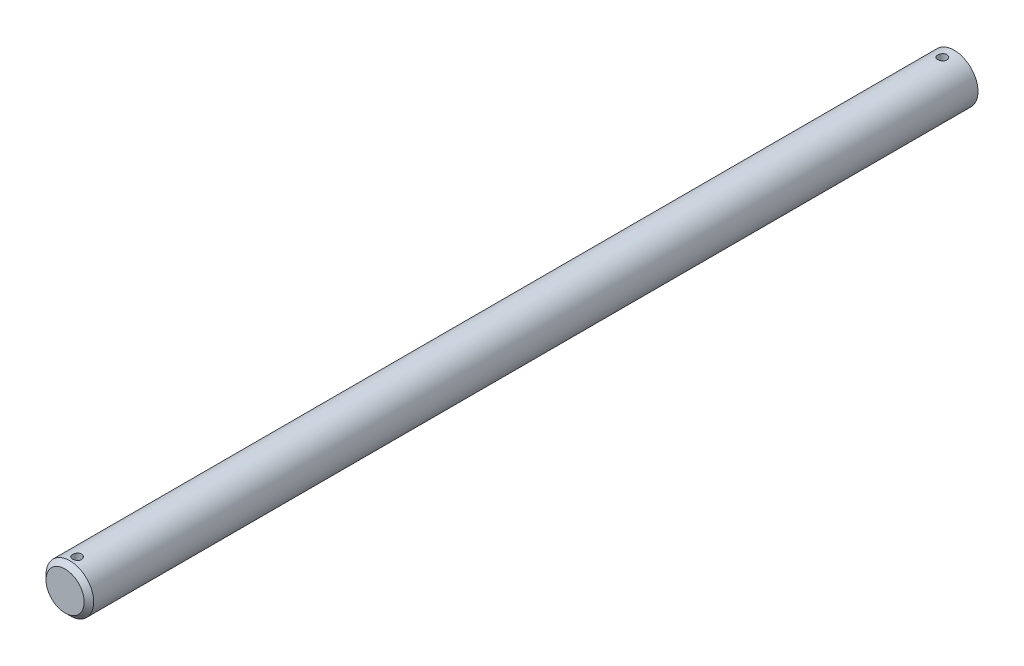
ISO-10303-21;
HEADER;
FILE_DESCRIPTION(('STEP AP214'),'2;1');
FILE_NAME('part.step','',(''),(''),'','','');
FILE_SCHEMA(('AUTOMOTIVE_DESIGN { 1 0 10303 214 1 1 1 1 }'));
ENDSEC;
DATA;
#1=APPLICATION_CONTEXT('core data for automotive mechanical design processes');
#2=APPLICATION_PROTOCOL_DEFINITION('international standard','automotive_design',2000,#1);
#3=PRODUCT_CONTEXT('',#1,'mechanical');
#4=PRODUCT('Part','Part','',(#3));
#5=PRODUCT_RELATED_PRODUCT_CATEGORY('part','',(#4));
#6=PRODUCT_DEFINITION_FORMATION('','',#4);
#7=PRODUCT_DEFINITION_CONTEXT('part definition',#1,'design');
#8=PRODUCT_DEFINITION('design','',#6,#7);
#9=PRODUCT_DEFINITION_SHAPE('','',#8);
#10=(LENGTH_UNIT() NAMED_UNIT(*) SI_UNIT(.MILLI.,.METRE.));
#11=(NAMED_UNIT(*) PLANE_ANGLE_UNIT() SI_UNIT($,.RADIAN.));
#12=(NAMED_UNIT(*) SI_UNIT($,.STERADIAN.) SOLID_ANGLE_UNIT());
#13=UNCERTAINTY_MEASURE_WITH_UNIT(LENGTH_MEASURE(1.E-05),#10,'distance_accuracy_value','');
#14=(GEOMETRIC_REPRESENTATION_CONTEXT(3) GLOBAL_UNCERTAINTY_ASSIGNED_CONTEXT((#13)) GLOBAL_UNIT_ASSIGNED_CONTEXT((#10,
#11,#12)) REPRESENTATION_CONTEXT('',''));
#15=CARTESIAN_POINT('',(0.,0.,0.));
#16=DIRECTION('',(0.,0.,1.));
#17=DIRECTION('',(1.,0.,0.));
#18=AXIS2_PLACEMENT_3D('',#15,#16,#17);
#19=CARTESIAN_POINT('',(0.,0.,304.8));
#20=DIRECTION('',(0.,0.,-1.));
#21=DIRECTION('',(-1.,0.,0.));
#22=AXIS2_PLACEMENT_3D('',#19,#20,#21);
#23=CYLINDRICAL_SURFACE('',#22,3.175);
#24=CARTESIAN_POINT('',(0.,-3.17500000000001,188.655762388));
#25=CARTESIAN_POINT('',(0.033127849378484,-3.17499940005936,188.655761122132));
#26=CARTESIAN_POINT('',(0.0662721689897592,-3.17447616437681,188.652987804467));
#27=CARTESIAN_POINT('',(0.131626820280966,-3.17243930650301,188.641974952437));
#28=CARTESIAN_POINT('',(0.163836339741667,-3.17092484847488,188.633730804777));
#29=CARTESIAN_POINT('',(0.226366769234935,-3.16707495697542,188.612037597188));
#30=CARTESIAN_POINT('',(0.256689356240747,-3.16474026510011,188.598593237808));
#31=CARTESIAN_POINT('',(0.314645664321686,-3.1595048514429,188.566894583721));
#32=CARTESIAN_POINT('',(0.34227960280819,-3.1566041754851,188.548640678371));
#33=CARTESIAN_POINT('',(0.394407912259925,-3.15051811645857,188.507609042574));
#34=CARTESIAN_POINT('',(0.418865429028267,-3.14733001333615,188.484784889647));
#35=CARTESIAN_POINT('',(0.463627811849755,-3.14104860763278,188.435360512206));
#36=CARTESIAN_POINT('',(0.483932379579185,-3.13795531187579,188.408760016654));
#37=CARTESIAN_POINT('',(0.519965775954876,-3.13218731275362,188.352277596681));
#38=CARTESIAN_POINT('',(0.535657115316884,-3.12951611636079,188.32237136603));
#39=CARTESIAN_POINT('',(0.561778643443758,-3.12493308056008,188.260288787289));
#40=CARTESIAN_POINT('',(0.572209285923865,-3.1230211756692,188.228112635243));
#41=CARTESIAN_POINT('',(0.587395056092022,-3.120200569874,188.162797905731));
#42=CARTESIAN_POINT('',(0.592214454824663,-3.11928051754792,188.129674771297));
#43=CARTESIAN_POINT('',(0.596240425878416,-3.11851356370003,188.063078238404));
#44=CARTESIAN_POINT('',(0.595447501537276,-3.11866656594196,188.029604871624));
#45=CARTESIAN_POINT('',(0.588323450296885,-3.12001809916009,187.96372370141));
#46=CARTESIAN_POINT('',(0.582065407796813,-3.12120283233474,187.931307670137));
#47=CARTESIAN_POINT('',(0.56430386010371,-3.12446266491103,187.867993921399));
#48=CARTESIAN_POINT('',(0.552800132013027,-3.12653780214715,187.837096268514));
#49=CARTESIAN_POINT('',(0.524802287242859,-3.13135905069247,187.777482506022));
#50=CARTESIAN_POINT('',(0.508278659956946,-3.13410911079899,187.748780588738));
#51=CARTESIAN_POINT('',(0.470730932942595,-3.13996773104909,187.694529261361));
#52=CARTESIAN_POINT('',(0.449706376466776,-3.14307632756161,187.668980171626));
#53=CARTESIAN_POINT('',(0.403359563188529,-3.14936188004891,187.621337483717));
#54=CARTESIAN_POINT('',(0.377974795254094,-3.15253914125163,187.599304691558));
#55=CARTESIAN_POINT('',(0.323837314723615,-3.15855900111739,187.559801108107));
#56=CARTESIAN_POINT('',(0.295084568364026,-3.16140159642489,187.542330362555));
#57=CARTESIAN_POINT('',(0.234963886209648,-3.16643757934512,187.512437841933));
#58=CARTESIAN_POINT('',(0.203592733389714,-3.16863015282215,187.500022391288));
#59=CARTESIAN_POINT('',(0.139159898923864,-3.17211275581705,187.480654369804));
#60=CARTESIAN_POINT('',(0.10609839726025,-3.17340288121049,187.473701218644));
#61=CARTESIAN_POINT('',(0.0397464966210308,-3.17492205629787,187.46553980694));
#62=CARTESIAN_POINT('',(0.00646668626417217,-3.17516649268311,187.464248232612));
#63=CARTESIAN_POINT('',(-0.0598333703365867,-3.17460925115548,187.467223156445));
#64=CARTESIAN_POINT('',(-0.0928536292531548,-3.1738076246401,187.471489381529));
#65=CARTESIAN_POINT('',(-0.157432999370983,-3.17125791126725,187.485389536338));
#66=CARTESIAN_POINT('',(-0.189001503602661,-3.16951726067194,187.494981309507));
#67=CARTESIAN_POINT('',(-0.250082300755404,-3.16528387378086,187.519214665378));
#68=CARTESIAN_POINT('',(-0.279594453904932,-3.16279108642312,187.53385659094));
#69=CARTESIAN_POINT('',(-0.336080366506809,-3.157291557982,187.567959020113));
#70=CARTESIAN_POINT('',(-0.363022863065382,-3.1542794982553,187.587470431107));
#71=CARTESIAN_POINT('',(-0.413281147045624,-3.1480892694748,187.630689086266));
#72=CARTESIAN_POINT('',(-0.43659659543635,-3.14491108492986,187.654396722222));
#73=CARTESIAN_POINT('',(-0.479255517992203,-3.13869576292426,187.705712027068));
#74=CARTESIAN_POINT('',(-0.498542136242496,-3.1356610588829,187.733367304662));
#75=CARTESIAN_POINT('',(-0.532196179135613,-3.1301252865148,187.791574070233));
#76=CARTESIAN_POINT('',(-0.546563786592779,-3.12762419835761,187.822125450522));
#77=CARTESIAN_POINT('',(-0.569891360504028,-3.12345793983175,187.885112841562));
#78=CARTESIAN_POINT('',(-0.578877385529318,-3.12178874798387,187.917538923013));
#79=CARTESIAN_POINT('',(-0.591267071076007,-3.11946609009084,187.983474879438));
#80=CARTESIAN_POINT('',(-0.594671361418134,-3.11881250944861,188.016984631701));
#81=CARTESIAN_POINT('',(-0.595779868526295,-3.11860088672156,188.083567194541));
#82=CARTESIAN_POINT('',(-0.593573770795147,-3.11902560714798,188.116638490442));
#83=CARTESIAN_POINT('',(-0.583720477284632,-3.12088450886938,188.181929921124));
#84=CARTESIAN_POINT('',(-0.576073314010797,-3.12231868413375,188.214150060988));
#85=CARTESIAN_POINT('',(-0.555592803846087,-3.126027641217,188.276776324153));
#86=CARTESIAN_POINT('',(-0.542769168607853,-3.12830084823627,188.30718572269));
#87=CARTESIAN_POINT('',(-0.512309542245322,-3.13343285059637,188.365435726402));
#88=CARTESIAN_POINT('',(-0.49467321113813,-3.13629168730423,188.39327614991));
#89=CARTESIAN_POINT('',(-0.4547770278788,-3.14232633736512,188.446047161017));
#90=CARTESIAN_POINT('',(-0.432451906336468,-3.1455062556199,188.470927942363));
#91=CARTESIAN_POINT('',(-0.383947958425856,-3.15179405961499,188.516620061853));
#92=CARTESIAN_POINT('',(-0.357768247938247,-3.15490192863972,188.537430463827));
#93=CARTESIAN_POINT('',(-0.302015900075408,-3.1607282796232,188.574566109824));
#94=CARTESIAN_POINT('',(-0.27241483753546,-3.1634430039313,188.590849286182));
#95=CARTESIAN_POINT('',(-0.210855763856364,-3.16814048941711,188.618185325028));
#96=CARTESIAN_POINT('',(-0.178899999270517,-3.17012393770744,188.629243100109));
#97=CARTESIAN_POINT('',(-0.122375296121229,-3.17273102874592,188.64356932216));
#98=CARTESIAN_POINT('',(-0.0981367934437089,-3.17357708754789,188.648133906905));
#99=CARTESIAN_POINT('',(-0.049268557448828,-3.17471178919249,188.654230872027));
#100=CARTESIAN_POINT('',(-0.0246388340934195,-3.1750004462058,188.655763329489));
#101=CARTESIAN_POINT('',(0.,-3.17500000000001,188.655762388));
#102=B_SPLINE_CURVE_WITH_KNOTS('',3,(#24,#25,#26,#27,#28,#29,#30,#31,#32,#33,#34,#35,#36,#37,
#38,#39,#40,#41,#42,#43,#44,#45,#46,#47,#48,#49,#50,#51,#52,#53,#54,#55,#56,#57,#58,#59,#60,#61,
#62,#63,#64,#65,#66,#67,#68,#69,#70,#71,#72,#73,#74,#75,#76,#77,#78,#79,#80,#81,#82,#83,#84,#85,
#86,#87,#88,#89,#90,#91,#92,#93,#94,#95,#96,#97,#98,#99,#100,#101),.UNSPECIFIED.,.T.,.F.,(4,2,2,
2,2,2,2,2,2,2,2,2,2,2,2,2,2,2,2,2,2,2,2,2,2,2,2,2,2,2,2,2,2,2,2,2,2,2,4),(0.,0.099293442257959,
0.198670720631257,0.297958379519774,0.397238003055785,0.497582499616608,0.597934201813108,
0.699080193564202,0.800217460363051,0.900184538548682,1.00014265136194,1.0987841586819,
1.19742985782943,1.29666707356097,1.39591436451039,1.4967258310918,1.59753830838151,
1.69847652240176,1.79940401117395,1.89884119086453,1.99827348496884,2.09692967832172,
2.19559257087285,2.2953336190078,2.39508398463951,2.4961589530434,2.59723016460249,
2.69780792915495,2.79837434413152,2.89734328229483,2.99631162921165,3.09509515682432,
3.19388566460124,3.29415524955411,3.39444786907213,3.49564344413668,3.59674369125816,
3.67059505483131,3.74444454087573),.UNSPECIFIED.);
#103=CARTESIAN_POINT('',(0.,-3.17500000000001,188.655762388));
#104=VERTEX_POINT('',#103);
#105=EDGE_CURVE('E10',#104,#104,#102,.T.);
#106=ORIENTED_EDGE('',*,*,#105,.T.);
#107=EDGE_LOOP('',(#106));
#108=FACE_BOUND('',#107,.T.);
#109=CARTESIAN_POINT('',(0.,3.17499999999999,188.655762388));
#110=CARTESIAN_POINT('',(-0.0331278493784867,3.17499940005934,188.655761122132));
#111=CARTESIAN_POINT('',(-0.0662721689897619,3.1744761643768,188.652987804467));
#112=CARTESIAN_POINT('',(-0.131626820280968,3.17243930650299,188.641974952437));
#113=CARTESIAN_POINT('',(-0.163836339741669,3.17092484847486,188.633730804777));
#114=CARTESIAN_POINT('',(-0.226366769234938,3.1670749569754,188.612037597188));
#115=CARTESIAN_POINT('',(-0.25668935624075,3.16474026510009,188.598593237808));
#116=CARTESIAN_POINT('',(-0.314645664321688,3.15950485144288,188.566894583721));
#117=CARTESIAN_POINT('',(-0.342279602808193,3.15660417548508,188.548640678371));
#118=CARTESIAN_POINT('',(-0.394407912259927,3.15051811645855,188.507609042574));
#119=CARTESIAN_POINT('',(-0.41886542902827,3.14733001333613,188.484784889647));
#120=CARTESIAN_POINT('',(-0.463627811849758,3.14104860763276,188.435360512206));
#121=CARTESIAN_POINT('',(-0.483932379579187,3.13795531187577,188.408760016654));
#122=CARTESIAN_POINT('',(-0.519965775954879,3.1321873127536,188.352277596681));
#123=CARTESIAN_POINT('',(-0.535657115316887,3.12951611636077,188.32237136603));
#124=CARTESIAN_POINT('',(-0.561778643443761,3.12493308056006,188.260288787289));
#125=CARTESIAN_POINT('',(-0.572209285923868,3.12302117566918,188.228112635243));
#126=CARTESIAN_POINT('',(-0.58739505609203,3.12020056987398,188.162797905731));
#127=CARTESIAN_POINT('',(-0.592214454824671,3.11928051754791,188.129674771297));
#128=CARTESIAN_POINT('',(-0.596240425878418,3.11851356370001,188.063078238404));
#129=CARTESIAN_POINT('',(-0.595447501537276,3.11866656594194,188.029604871624));
#130=CARTESIAN_POINT('',(-0.588323450296887,3.12001809916007,187.96372370141));
#131=CARTESIAN_POINT('',(-0.582065407796816,3.12120283233472,187.931307670137));
#132=CARTESIAN_POINT('',(-0.564303860103713,3.12446266491101,187.867993921399));
#133=CARTESIAN_POINT('',(-0.552800132013029,3.12653780214713,187.837096268514));
#134=CARTESIAN_POINT('',(-0.524802287242862,3.13135905069245,187.777482506022));
#135=CARTESIAN_POINT('',(-0.508278659956949,3.13410911079897,187.748780588738));
#136=CARTESIAN_POINT('',(-0.470730932942598,3.13996773104907,187.694529261361));
#137=CARTESIAN_POINT('',(-0.449706376466779,3.14307632756159,187.668980171626));
#138=CARTESIAN_POINT('',(-0.403359563188532,3.14936188004889,187.621337483717));
#139=CARTESIAN_POINT('',(-0.377974795254097,3.15253914125161,187.599304691558));
#140=CARTESIAN_POINT('',(-0.323837314723618,3.15855900111738,187.559801108107));
#141=CARTESIAN_POINT('',(-0.295084568364029,3.16140159642487,187.542330362555));
#142=CARTESIAN_POINT('',(-0.234963886209651,3.1664375793451,187.512437841933));
#143=CARTESIAN_POINT('',(-0.203592733389717,3.16863015282214,187.500022391288));
#144=CARTESIAN_POINT('',(-0.139159898923867,3.17211275581703,187.480654369804));
#145=CARTESIAN_POINT('',(-0.106098397260253,3.17340288121047,187.473701218644));
#146=CARTESIAN_POINT('',(-0.0397464966210335,3.17492205629785,187.46553980694));
#147=CARTESIAN_POINT('',(-0.00646668626417488,3.1751664926831,187.464248232612));
#148=CARTESIAN_POINT('',(0.059833370336584,3.17460925115546,187.467223156445));
#149=CARTESIAN_POINT('',(0.0928536292531521,3.17380762464008,187.471489381529));
#150=CARTESIAN_POINT('',(0.157432999370981,3.17125791126723,187.485389536338));
#151=CARTESIAN_POINT('',(0.189001503602658,3.16951726067192,187.494981309507));
#152=CARTESIAN_POINT('',(0.250082300755401,3.16528387378084,187.519214665378));
#153=CARTESIAN_POINT('',(0.27959445390493,3.1627910864231,187.53385659094));
#154=CARTESIAN_POINT('',(0.336080366506806,3.15729155798198,187.567959020113));
#155=CARTESIAN_POINT('',(0.36302286306538,3.15427949825529,187.587470431107));
#156=CARTESIAN_POINT('',(0.413281147045622,3.14808926947478,187.630689086266));
#157=CARTESIAN_POINT('',(0.436596595436347,3.14491108492984,187.654396722222));
#158=CARTESIAN_POINT('',(0.4792555179922,3.13869576292424,187.705712027068));
#159=CARTESIAN_POINT('',(0.498542136242493,3.13566105888288,187.733367304662));
#160=CARTESIAN_POINT('',(0.53219617913561,3.13012528651479,187.791574070233));
#161=CARTESIAN_POINT('',(0.546563786592776,3.12762419835759,187.822125450522));
#162=CARTESIAN_POINT('',(0.569891360504025,3.12345793983173,187.885112841562));
#163=CARTESIAN_POINT('',(0.578877385529315,3.12178874798385,187.917538923013));
#164=CARTESIAN_POINT('',(0.591267071076004,3.11946609009082,187.983474879438));
#165=CARTESIAN_POINT('',(0.594671361418131,3.11881250944859,188.016984631701));
#166=CARTESIAN_POINT('',(0.595779868526292,3.11860088672155,188.083567194541));
#167=CARTESIAN_POINT('',(0.593573770795144,3.11902560714797,188.116638490442));
#168=CARTESIAN_POINT('',(0.583720477284629,3.12088450886936,188.181929921124));
#169=CARTESIAN_POINT('',(0.576073314010794,3.12231868413373,188.214150060988));
#170=CARTESIAN_POINT('',(0.555592803846084,3.12602764121698,188.276776324153));
#171=CARTESIAN_POINT('',(0.542769168607851,3.12830084823626,188.30718572269));
#172=CARTESIAN_POINT('',(0.512309542245319,3.13343285059635,188.365435726402));
#173=CARTESIAN_POINT('',(0.494673211138128,3.13629168730421,188.39327614991));
#174=CARTESIAN_POINT('',(0.454777027878797,3.1423263373651,188.446047161017));
#175=CARTESIAN_POINT('',(0.432451906336466,3.14550625561988,188.470927942363));
#176=CARTESIAN_POINT('',(0.383947958425854,3.15179405961497,188.516620061853));
#177=CARTESIAN_POINT('',(0.357768247938244,3.1549019286397,188.537430463827));
#178=CARTESIAN_POINT('',(0.302015900075406,3.16072827962318,188.574566109824));
#179=CARTESIAN_POINT('',(0.272414837535457,3.16344300393128,188.590849286182));
#180=CARTESIAN_POINT('',(0.210855763856361,3.16814048941709,188.618185325028));
#181=CARTESIAN_POINT('',(0.178899999270514,3.17012393770742,188.629243100109));
#182=CARTESIAN_POINT('',(0.122375296121227,3.17273102874591,188.64356932216));
#183=CARTESIAN_POINT('',(0.0981367934437061,3.17357708754787,188.648133906905));
#184=CARTESIAN_POINT('',(0.0492685574488253,3.17471178919247,188.654230872027));
#185=CARTESIAN_POINT('',(0.0246388340934168,3.17500044620578,188.655763329489));
#186=CARTESIAN_POINT('',(0.,3.17499999999999,188.655762388));
#187=B_SPLINE_CURVE_WITH_KNOTS('',3,(#109,#110,#111,#112,#113,#114,#115,#116,#117,#118,#119,
#120,#121,#122,#123,#124,#125,#126,#127,#128,#129,#130,#131,#132,#133,#134,#135,#136,#137,#138,
#139,#140,#141,#142,#143,#144,#145,#146,#147,#148,#149,#150,#151,#152,#153,#154,#155,#156,#157,
#158,#159,#160,#161,#162,#163,#164,#165,#166,#167,#168,#169,#170,#171,#172,#173,#174,#175,#176,
#177,#178,#179,#180,#181,#182,#183,#184,#185,#186),.UNSPECIFIED.,.T.,.F.,(4,2,2,2,2,2,2,2,2,2,2,
2,2,2,2,2,2,2,2,2,2,2,2,2,2,2,2,2,2,2,2,2,2,2,2,2,2,2,4),(0.,0.099293442257959,
0.198670720631257,0.297958379519774,0.397238003055785,0.497582499616609,0.597934201813108,
0.699080193564202,0.800217460363051,0.900184538548737,1.00014265136194,1.0987841586819,
1.19742985782943,1.29666707356097,1.39591436451039,1.4967258310918,1.59753830838151,
1.69847652240176,1.79940401117395,1.89884119086453,1.99827348496884,2.09692967832172,
2.19559257087285,2.29533361900781,2.39508398463951,2.4961589530434,2.59723016460249,
2.69780792915495,2.79837434413152,2.89734328229483,2.99631162921165,3.09509515682432,
3.19388566460124,3.29415524955411,3.39444786907213,3.49564344413668,3.59674369125816,
3.67059505483131,3.74444454087573),.UNSPECIFIED.);
#188=CARTESIAN_POINT('',(0.,3.17499999999999,188.655762388));
#189=VERTEX_POINT('',#188);
#190=EDGE_CURVE('E45',#189,#189,#187,.T.);
#191=ORIENTED_EDGE('',*,*,#190,.T.);
#192=EDGE_LOOP('',(#191));
#193=FACE_BOUND('',#192,.T.);
#194=CARTESIAN_POINT('',(0.,-3.17500000000001,303.8078125));
#195=CARTESIAN_POINT('',(0.0331278493784956,-3.17499940005936,303.807811234132));
#196=CARTESIAN_POINT('',(0.0662721689897699,-3.17447616437681,303.805037916467));
#197=CARTESIAN_POINT('',(0.131626820280976,-3.17243930650301,303.794025064437));
#198=CARTESIAN_POINT('',(0.163836339741677,-3.17092484847488,303.785780916777));
#199=CARTESIAN_POINT('',(0.226366769234958,-3.16707495697542,303.764087709188));
#200=CARTESIAN_POINT('',(0.256689356240781,-3.16474026510011,303.750643349808));
#201=CARTESIAN_POINT('',(0.314645664321714,-3.15950485144289,303.718944695721));
#202=CARTESIAN_POINT('',(0.342279602808203,-3.15660417548509,303.700690790371));
#203=CARTESIAN_POINT('',(0.394407912259931,-3.15051811645857,303.659659154574));
#204=CARTESIAN_POINT('',(0.41886542902828,-3.14733001333615,303.636835001646));
#205=CARTESIAN_POINT('',(0.463627811849776,-3.14104860763277,303.587410624206));
#206=CARTESIAN_POINT('',(0.483932379579207,-3.13795531187578,303.560810128654));
#207=CARTESIAN_POINT('',(0.519965775954901,-3.13218731275362,303.504327708681));
#208=CARTESIAN_POINT('',(0.535657115316909,-3.12951611636079,303.47442147803));
#209=CARTESIAN_POINT('',(0.561778643443776,-3.12493308056008,303.412338899289));
#210=CARTESIAN_POINT('',(0.572209285923881,-3.1230211756692,303.380162747243));
#211=CARTESIAN_POINT('',(0.587395056092034,-3.120200569874,303.314848017731));
#212=CARTESIAN_POINT('',(0.592214454824669,-3.11928051754792,303.281724883297));
#213=CARTESIAN_POINT('',(0.596240425878417,-3.11851356370003,303.215128350404));
#214=CARTESIAN_POINT('',(0.595447501537278,-3.11866656594196,303.181654983624));
#215=CARTESIAN_POINT('',(0.58832345029689,-3.12001809916009,303.11577381341));
#216=CARTESIAN_POINT('',(0.582065407796815,-3.12120283233474,303.083357782137));
#217=CARTESIAN_POINT('',(0.564303860103707,-3.12446266491103,303.020044033399));
#218=CARTESIAN_POINT('',(0.552800132013023,-3.12653780214715,302.989146380513));
#219=CARTESIAN_POINT('',(0.524802287242861,-3.13135905069247,302.929532618022));
#220=CARTESIAN_POINT('',(0.508278659956958,-3.13410911079899,302.900830700738));
#221=CARTESIAN_POINT('',(0.470730932942623,-3.13996773104909,302.846579373361));
#222=CARTESIAN_POINT('',(0.449706376466809,-3.14307632756161,302.821030283626));
#223=CARTESIAN_POINT('',(0.403359563188558,-3.14936188004891,302.773387595718));
#224=CARTESIAN_POINT('',(0.377974795254109,-3.15253914125163,302.751354803558));
#225=CARTESIAN_POINT('',(0.323837314723599,-3.1585590011174,302.711851220107));
#226=CARTESIAN_POINT('',(0.295084568363997,-3.16140159642489,302.694380474555));
#227=CARTESIAN_POINT('',(0.234963886209613,-3.16643757934512,302.664487953933));
#228=CARTESIAN_POINT('',(0.203592733389688,-3.16863015282216,302.652072503288));
#229=CARTESIAN_POINT('',(0.139159898923856,-3.17211275581705,302.632704481804));
#230=CARTESIAN_POINT('',(0.106098397260251,-3.17340288121049,302.625751330645));
#231=CARTESIAN_POINT('',(0.0397464966210445,-3.17492205629787,302.61758991894));
#232=CARTESIAN_POINT('',(0.00646668626418795,-3.17516649268312,302.616298344612));
#233=CARTESIAN_POINT('',(-0.0598333703365708,-3.17460925115548,302.619273268446));
#234=CARTESIAN_POINT('',(-0.0928536292531409,-3.1738076246401,302.623539493529));
#235=CARTESIAN_POINT('',(-0.157432999370963,-3.17125791126725,302.637439648338));
#236=CARTESIAN_POINT('',(-0.189001503602631,-3.16951726067195,302.647031421507));
#237=CARTESIAN_POINT('',(-0.250082300755378,-3.16528387378086,302.671264777378));
#238=CARTESIAN_POINT('',(-0.279594453904919,-3.16279108642312,302.68590670294));
#239=CARTESIAN_POINT('',(-0.33608036650679,-3.157291557982,302.720009132113));
#240=CARTESIAN_POINT('',(-0.363022863065345,-3.15427949825531,302.739520543107));
#241=CARTESIAN_POINT('',(-0.413281147045584,-3.14808926947481,302.782739198266));
#242=CARTESIAN_POINT('',(-0.436596595436325,-3.14491108492986,302.806446834222));
#243=CARTESIAN_POINT('',(-0.479255517992183,-3.13869576292427,302.857762139068));
#244=CARTESIAN_POINT('',(-0.498542136242465,-3.13566105888291,302.885417416662));
#245=CARTESIAN_POINT('',(-0.532196179135576,-3.13012528651481,302.943624182233));
#246=CARTESIAN_POINT('',(-0.546563786592745,-3.12762419835762,302.974175562522));
#247=CARTESIAN_POINT('',(-0.569891360503998,-3.12345793983176,303.037162953562));
#248=CARTESIAN_POINT('',(-0.578877385529289,-3.12178874798387,303.069589035013));
#249=CARTESIAN_POINT('',(-0.591267071075983,-3.11946609009085,303.135524991438));
#250=CARTESIAN_POINT('',(-0.594671361418111,-3.11881250944861,303.169034743701));
#251=CARTESIAN_POINT('',(-0.595779868526272,-3.11860088672157,303.235617306541));
#252=CARTESIAN_POINT('',(-0.593573770795127,-3.11902560714799,303.268688602442));
#253=CARTESIAN_POINT('',(-0.583720477284618,-3.12088450886938,303.333980033124));
#254=CARTESIAN_POINT('',(-0.57607331401078,-3.12231868413375,303.366200172988));
#255=CARTESIAN_POINT('',(-0.555592803846065,-3.12602764121701,303.428826436153));
#256=CARTESIAN_POINT('',(-0.542769168607834,-3.12830084823628,303.45923583469));
#257=CARTESIAN_POINT('',(-0.512309542245301,-3.13343285059638,303.517485838402));
#258=CARTESIAN_POINT('',(-0.4946732111381,-3.13629168730423,303.54532626191));
#259=CARTESIAN_POINT('',(-0.454777027878766,-3.14232633736512,303.598097273017));
#260=CARTESIAN_POINT('',(-0.432451906336444,-3.1455062556199,303.622978054363));
#261=CARTESIAN_POINT('',(-0.383947958425829,-3.15179405961499,303.668670173853));
#262=CARTESIAN_POINT('',(-0.357768247938207,-3.15490192863972,303.689480575826));
#263=CARTESIAN_POINT('',(-0.302015900075373,-3.16072827962321,303.726616221824));
#264=CARTESIAN_POINT('',(-0.272414837535442,-3.1634430039313,303.742899398182));
#265=CARTESIAN_POINT('',(-0.21085576385636,-3.16814048941711,303.770235437028));
#266=CARTESIAN_POINT('',(-0.178899999270509,-3.17012393770744,303.781293212109));
#267=CARTESIAN_POINT('',(-0.122375296121215,-3.17273102874592,303.79561943416));
#268=CARTESIAN_POINT('',(-0.0981367934436929,-3.17357708754789,303.800184018905));
#269=CARTESIAN_POINT('',(-0.0492685574488116,-3.17471178919249,303.806280984027));
#270=CARTESIAN_POINT('',(-0.0246388340934046,-3.1750004462058,303.807813441489));
#271=CARTESIAN_POINT('',(0.,-3.17500000000001,303.8078125));
#272=B_SPLINE_CURVE_WITH_KNOTS('',3,(#194,#195,#196,#197,#198,#199,#200,#201,#202,#203,#204,
#205,#206,#207,#208,#209,#210,#211,#212,#213,#214,#215,#216,#217,#218,#219,#220,#221,#222,#223,
#224,#225,#226,#227,#228,#229,#230,#231,#232,#233,#234,#235,#236,#237,#238,#239,#240,#241,#242,
#243,#244,#245,#246,#247,#248,#249,#250,#251,#252,#253,#254,#255,#256,#257,#258,#259,#260,#261,
#262,#263,#264,#265,#266,#267,#268,#269,#270,#271),.UNSPECIFIED.,.T.,.F.,(4,2,2,2,2,2,2,2,2,2,2,
2,2,2,2,2,2,2,2,2,2,2,2,2,2,2,2,2,2,2,2,2,2,2,2,2,2,2,4),(0.,0.0992934422579537,
0.198670720631256,0.297958379519797,0.397238003055775,0.497582499616633,0.597934201813132,
0.699080193564254,0.800217460363045,0.900184538548675,1.00014265136191,1.09878415868192,
1.19742985782948,1.29666707356095,1.39591436451032,1.49672583109181,1.59753830838155,
1.69847652240177,1.79940401117393,1.89884119086451,1.99827348496881,2.09692967832168,
2.1955925708728,2.29533361900778,2.39508398463947,2.49615895304333,2.59723016460242,
2.69780792915486,2.79837434413146,2.89734328229474,2.99631162921161,3.09509515682426,
3.19388566460124,3.29415524955408,3.39444786907209,3.49564344413663,3.5967436912581,
3.67059505483126,3.74444454087568),.UNSPECIFIED.);
#273=CARTESIAN_POINT('',(0.,-3.17500000000001,303.8078125));
#274=VERTEX_POINT('',#273);
#275=EDGE_CURVE('E49',#274,#274,#272,.T.);
#276=ORIENTED_EDGE('',*,*,#275,.T.);
#277=EDGE_LOOP('',(#276));
#278=FACE_BOUND('',#277,.T.);
#279=CARTESIAN_POINT('',(0.,3.17499999999999,303.8078125));
#280=CARTESIAN_POINT('',(-0.0331278493784698,3.17499940005934,303.807811234132));
#281=CARTESIAN_POINT('',(-0.0662721689897442,3.17447616437679,303.805037916467));
#282=CARTESIAN_POINT('',(-0.13162682028095,3.17243930650299,303.794025064437));
#283=CARTESIAN_POINT('',(-0.163836339741651,3.17092484847486,303.785780916777));
#284=CARTESIAN_POINT('',(-0.226366769234933,3.1670749569754,303.764087709188));
#285=CARTESIAN_POINT('',(-0.256689356240756,3.16474026510009,303.750643349808));
#286=CARTESIAN_POINT('',(-0.314645664321688,3.15950485144288,303.718944695721));
#287=CARTESIAN_POINT('',(-0.342279602808177,3.15660417548508,303.700690790371));
#288=CARTESIAN_POINT('',(-0.394407912259905,3.15051811645856,303.659659154574));
#289=CARTESIAN_POINT('',(-0.418865429028254,3.14733001333614,303.636835001646));
#290=CARTESIAN_POINT('',(-0.46362781184975,3.14104860763276,303.587410624206));
#291=CARTESIAN_POINT('',(-0.483932379579181,3.13795531187577,303.560810128654));
#292=CARTESIAN_POINT('',(-0.519965775954875,3.1321873127536,303.504327708681));
#293=CARTESIAN_POINT('',(-0.535657115316883,3.12951611636077,303.47442147803));
#294=CARTESIAN_POINT('',(-0.56177864344375,3.12493308056007,303.412338899289));
#295=CARTESIAN_POINT('',(-0.572209285923855,3.12302117566919,303.380162747243));
#296=CARTESIAN_POINT('',(-0.587395056092009,3.12020056987399,303.314848017731));
#297=CARTESIAN_POINT('',(-0.592214454824643,3.11928051754791,303.281724883297));
#298=CARTESIAN_POINT('',(-0.596240425878392,3.11851356370001,303.215128350404));
#299=CARTESIAN_POINT('',(-0.595447501537253,3.11866656594195,303.181654983624));
#300=CARTESIAN_POINT('',(-0.588323450296865,3.12001809916008,303.11577381341));
#301=CARTESIAN_POINT('',(-0.58206540779679,3.12120283233473,303.083357782137));
#302=CARTESIAN_POINT('',(-0.564303860103681,3.12446266491101,303.020044033399));
#303=CARTESIAN_POINT('',(-0.552800132012997,3.12653780214714,302.989146380513));
#304=CARTESIAN_POINT('',(-0.524802287242835,3.13135905069245,302.929532618022));
#305=CARTESIAN_POINT('',(-0.508278659956932,3.13410911079897,302.900830700738));
#306=CARTESIAN_POINT('',(-0.470730932942597,3.13996773104907,302.846579373361));
#307=CARTESIAN_POINT('',(-0.449706376466783,3.14307632756159,302.821030283626));
#308=CARTESIAN_POINT('',(-0.403359563188532,3.14936188004889,302.773387595718));
#309=CARTESIAN_POINT('',(-0.377974795254083,3.15253914125161,302.751354803558));
#310=CARTESIAN_POINT('',(-0.323837314723573,3.15855900111738,302.711851220107));
#311=CARTESIAN_POINT('',(-0.295084568363971,3.16140159642487,302.694380474555));
#312=CARTESIAN_POINT('',(-0.234963886209588,3.16643757934511,302.664487953933));
#313=CARTESIAN_POINT('',(-0.203592733389662,3.16863015282214,302.652072503288));
#314=CARTESIAN_POINT('',(-0.13915989892383,3.17211275581703,302.632704481804));
#315=CARTESIAN_POINT('',(-0.106098397260226,3.17340288121047,302.625751330645));
#316=CARTESIAN_POINT('',(-0.0397464966210191,3.17492205629785,302.61758991894));
#317=CARTESIAN_POINT('',(-0.00646668626416251,3.1751664926831,302.616298344612));
#318=CARTESIAN_POINT('',(0.0598333703365961,3.17460925115546,302.619273268446));
#319=CARTESIAN_POINT('',(0.0928536292531661,3.17380762464008,302.623539493529));
#320=CARTESIAN_POINT('',(0.157432999370988,3.17125791126723,302.637439648338));
#321=CARTESIAN_POINT('',(0.189001503602656,3.16951726067193,302.647031421507));
#322=CARTESIAN_POINT('',(0.250082300755404,3.16528387378084,302.671264777378));
#323=CARTESIAN_POINT('',(0.279594453904944,3.1627910864231,302.68590670294));
#324=CARTESIAN_POINT('',(0.336080366506815,3.15729155798198,302.720009132113));
#325=CARTESIAN_POINT('',(0.36302286306537,3.15427949825529,302.739520543107));
#326=CARTESIAN_POINT('',(0.413281147045609,3.14808926947478,302.782739198266));
#327=CARTESIAN_POINT('',(0.436596595436351,3.14491108492984,302.806446834222));
#328=CARTESIAN_POINT('',(0.479255517992208,3.13869576292424,302.857762139068));
#329=CARTESIAN_POINT('',(0.49854213624249,3.13566105888288,302.885417416662));
#330=CARTESIAN_POINT('',(0.532196179135601,3.13012528651479,302.943624182233));
#331=CARTESIAN_POINT('',(0.54656378659277,3.1276241983576,302.974175562522));
#332=CARTESIAN_POINT('',(0.569891360504023,3.12345793983173,303.037162953562));
#333=CARTESIAN_POINT('',(0.578877385529315,3.12178874798385,303.069589035013));
#334=CARTESIAN_POINT('',(0.591267071076009,3.11946609009082,303.135524991438));
#335=CARTESIAN_POINT('',(0.594671361418136,3.11881250944859,303.169034743701));
#336=CARTESIAN_POINT('',(0.595779868526297,3.11860088672155,303.235617306541));
#337=CARTESIAN_POINT('',(0.593573770795153,3.11902560714796,303.268688602442));
#338=CARTESIAN_POINT('',(0.583720477284644,3.12088450886935,303.333980033124));
#339=CARTESIAN_POINT('',(0.576073314010806,3.12231868413373,303.366200172988));
#340=CARTESIAN_POINT('',(0.555592803846091,3.12602764121698,303.428826436153));
#341=CARTESIAN_POINT('',(0.54276916860786,3.12830084823626,303.45923583469));
#342=CARTESIAN_POINT('',(0.512309542245326,3.13343285059635,303.517485838402));
#343=CARTESIAN_POINT('',(0.494673211138126,3.13629168730421,303.54532626191));
#344=CARTESIAN_POINT('',(0.454777027878792,3.1423263373651,303.598097273017));
#345=CARTESIAN_POINT('',(0.432451906336469,3.14550625561988,303.622978054363));
#346=CARTESIAN_POINT('',(0.383947958425855,3.15179405961497,303.668670173853));
#347=CARTESIAN_POINT('',(0.357768247938233,3.1549019286397,303.689480575826));
#348=CARTESIAN_POINT('',(0.302015900075392,3.16072827962318,303.726616221824));
#349=CARTESIAN_POINT('',(0.272414837535453,3.16344300393128,303.742899398182));
#350=CARTESIAN_POINT('',(0.210855763856371,3.16814048941709,303.770235437028));
#351=CARTESIAN_POINT('',(0.178899999270528,3.17012393770742,303.781293212109));
#352=CARTESIAN_POINT('',(0.122375296121242,3.1727310287459,303.79561943416));
#353=CARTESIAN_POINT('',(0.0981367934437188,3.17357708754787,303.800184018905));
#354=CARTESIAN_POINT('',(0.0492685574488371,3.17471178919247,303.806280984027));
#355=CARTESIAN_POINT('',(0.0246388340934303,3.17500044620578,303.807813441489));
#356=CARTESIAN_POINT('',(0.,3.17499999999999,303.8078125));
#357=B_SPLINE_CURVE_WITH_KNOTS('',3,(#279,#280,#281,#282,#283,#284,#285,#286,#287,#288,#289,
#290,#291,#292,#293,#294,#295,#296,#297,#298,#299,#300,#301,#302,#303,#304,#305,#306,#307,#308,
#309,#310,#311,#312,#313,#314,#315,#316,#317,#318,#319,#320,#321,#322,#323,#324,#325,#326,#327,
#328,#329,#330,#331,#332,#333,#334,#335,#336,#337,#338,#339,#340,#341,#342,#343,#344,#345,#346,
#347,#348,#349,#350,#351,#352,#353,#354,#355,#356),.UNSPECIFIED.,.T.,.F.,(4,2,2,2,2,2,2,2,2,2,2,
2,2,2,2,2,2,2,2,2,2,2,2,2,2,2,2,2,2,2,2,2,2,2,2,2,2,2,4),(0.,0.0992934422579536,
0.198670720631256,0.297958379519797,0.397238003055775,0.497582499616632,0.597934201813132,
0.699080193564254,0.800217460363045,0.900184538548675,1.00014265136191,1.09878415868192,
1.19742985782948,1.29666707356095,1.39591436451032,1.49672583109181,1.59753830838155,
1.69847652240177,1.79940401117393,1.89884119086451,1.99827348496881,2.09692967832168,
2.1955925708728,2.29533361900778,2.39508398463947,2.49615895304333,2.59723016460242,
2.69780792915486,2.79837434413146,2.89734328229474,2.99631162921161,3.09509515682425,
3.19388566460124,3.29415524955408,3.39444786907209,3.49564344413664,3.5967436912581,
3.67059505483125,3.74444454087568),.UNSPECIFIED.);
#358=CARTESIAN_POINT('',(0.,3.17499999999999,303.8078125));
#359=VERTEX_POINT('',#358);
#360=EDGE_CURVE('E53',#359,#359,#357,.T.);
#361=ORIENTED_EDGE('',*,*,#360,.T.);
#362=EDGE_LOOP('',(#361));
#363=FACE_BOUND('',#362,.T.);
#364=CARTESIAN_POINT('',(0.,0.,186.472949888));
#365=DIRECTION('',(0.,0.,1.));
#366=DIRECTION('',(1.,0.,0.));
#367=AXIS2_PLACEMENT_3D('',#364,#365,#366);
#368=CIRCLE('',#367,3.175);
#369=CARTESIAN_POINT('',(3.175,0.,186.472949888));
#370=VERTEX_POINT('',#369);
#371=EDGE_CURVE('E88',#370,#370,#368,.T.);
#372=ORIENTED_EDGE('',*,*,#371,.T.);
#373=EDGE_LOOP('',(#372));
#374=FACE_BOUND('',#373,.T.);
#375=CARTESIAN_POINT('',(0.,0.,304.165));
#376=DIRECTION('',(0.,0.,1.));
#377=DIRECTION('',(1.,0.,0.));
#378=AXIS2_PLACEMENT_3D('',#375,#376,#377);
#379=CIRCLE('',#378,3.175);
#380=CARTESIAN_POINT('',(3.175,0.,304.165));
#381=VERTEX_POINT('',#380);
#382=EDGE_CURVE('E85',#381,#381,#379,.F.);
#383=ORIENTED_EDGE('',*,*,#382,.T.);
#384=EDGE_LOOP('',(#383));
#385=FACE_BOUND('',#384,.T.);
#386=ADVANCED_FACE('F34',(#108,#193,#278,#363,#374,#385),#23,.T.);
#387=CARTESIAN_POINT('',(0.,0.,304.8));
#388=DIRECTION('',(0.,0.,1.));
#389=DIRECTION('',(1.,0.,0.));
#390=AXIS2_PLACEMENT_3D('',#387,#388,#389);
#391=PLANE('',#390);
#392=CARTESIAN_POINT('',(0.,0.,304.8));
#393=DIRECTION('',(0.,0.,1.));
#394=DIRECTION('',(1.,0.,0.));
#395=AXIS2_PLACEMENT_3D('',#392,#393,#394);
#396=CIRCLE('',#395,2.54000000000021);
#397=CARTESIAN_POINT('',(2.54000000000021,0.,304.8));
#398=VERTEX_POINT('',#397);
#399=EDGE_CURVE('E82',#398,#398,#396,.T.);
#400=ORIENTED_EDGE('',*,*,#399,.T.);
#401=EDGE_LOOP('',(#400));
#402=FACE_BOUND('',#401,.T.);
#403=ADVANCED_FACE('F98',(#402),#391,.T.);
#404=CARTESIAN_POINT('',(0.,0.,304.8));
#405=DIRECTION('',(0.,0.,-1.));
#406=DIRECTION('',(-1.,0.,0.));
#407=AXIS2_PLACEMENT_3D('',#404,#405,#406);
#408=CONICAL_SURFACE('',#407,2.54000000000021,0.785398163397418);
#409=ORIENTED_EDGE('',*,*,#382,.F.);
#410=EDGE_LOOP('',(#409));
#411=FACE_BOUND('',#410,.T.);
#412=ORIENTED_EDGE('',*,*,#399,.F.);
#413=EDGE_LOOP('',(#412));
#414=FACE_BOUND('',#413,.T.);
#415=ADVANCED_FACE('F36',(#411,#414),#408,.T.);
#416=CARTESIAN_POINT('',(0.,0.,186.472949888));
#417=DIRECTION('',(0.,0.,1.));
#418=DIRECTION('',(1.,0.,0.));
#419=AXIS2_PLACEMENT_3D('',#416,#417,#418);
#420=PLANE('',#419);
#421=ORIENTED_EDGE('',*,*,#371,.F.);
#422=EDGE_LOOP('',(#421));
#423=FACE_BOUND('',#422,.T.);
#424=ADVANCED_FACE('F74',(#423),#420,.F.);
#425=CARTESIAN_POINT('',(0.,-3.17500000000001,303.2125));
#426=DIRECTION('',(0.,1.,0.));
#427=DIRECTION('',(0.,0.,1.));
#428=AXIS2_PLACEMENT_3D('',#425,#426,#427);
#429=CYLINDRICAL_SURFACE('',#428,0.595312500000002);
#430=ORIENTED_EDGE('',*,*,#360,.F.);
#431=EDGE_LOOP('',(#430));
#432=FACE_BOUND('',#431,.T.);
#433=ORIENTED_EDGE('',*,*,#275,.F.);
#434=EDGE_LOOP('',(#433));
#435=FACE_BOUND('',#434,.T.);
#436=ADVANCED_FACE('F68',(#432,#435),#429,.F.);
#437=CARTESIAN_POINT('',(0.,-3.17500000000001,188.060449888));
#438=DIRECTION('',(0.,1.,0.));
#439=DIRECTION('',(0.,0.,1.));
#440=AXIS2_PLACEMENT_3D('',#437,#438,#439);
#441=CYLINDRICAL_SURFACE('',#440,0.59531250000001);
#442=ORIENTED_EDGE('',*,*,#190,.F.);
#443=EDGE_LOOP('',(#442));
#444=FACE_BOUND('',#443,.T.);
#445=ORIENTED_EDGE('',*,*,#105,.F.);
#446=EDGE_LOOP('',(#445));
#447=FACE_BOUND('',#446,.T.);
#448=ADVANCED_FACE('F65',(#444,#447),#441,.F.);
#449=CLOSED_SHELL('',(#386,#403,#415,#424,#436,#448));
#450=MANIFOLD_SOLID_BREP('B2',#449);
#451=ADVANCED_BREP_SHAPE_REPRESENTATION('',(#18,#450),#14);
#452=SHAPE_DEFINITION_REPRESENTATION(#9,#451);
ENDSEC;
END-ISO-10303-21;
